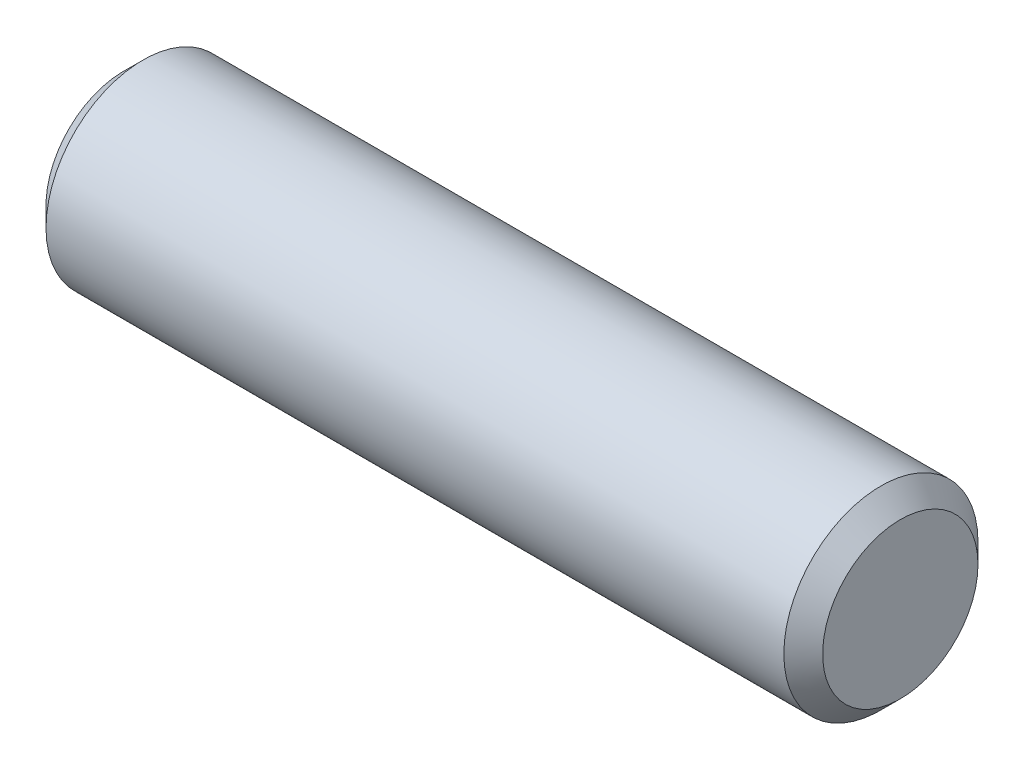
ISO-10303-21;
HEADER;
FILE_DESCRIPTION(('STEP AP214'),'2;1');
FILE_NAME('part.step','',(''),(''),'','','');
FILE_SCHEMA(('AUTOMOTIVE_DESIGN { 1 0 10303 214 1 1 1 1 }'));
ENDSEC;
DATA;
#1=APPLICATION_CONTEXT('core data for automotive mechanical design processes');
#2=APPLICATION_PROTOCOL_DEFINITION('international standard','automotive_design',2000,#1);
#3=PRODUCT_CONTEXT('',#1,'mechanical');
#4=PRODUCT('Part','Part','',(#3));
#5=PRODUCT_RELATED_PRODUCT_CATEGORY('part','',(#4));
#6=PRODUCT_DEFINITION_FORMATION('','',#4);
#7=PRODUCT_DEFINITION_CONTEXT('part definition',#1,'design');
#8=PRODUCT_DEFINITION('design','',#6,#7);
#9=PRODUCT_DEFINITION_SHAPE('','',#8);
#10=(LENGTH_UNIT() NAMED_UNIT(*) SI_UNIT(.MILLI.,.METRE.));
#11=(NAMED_UNIT(*) PLANE_ANGLE_UNIT() SI_UNIT($,.RADIAN.));
#12=(NAMED_UNIT(*) SI_UNIT($,.STERADIAN.) SOLID_ANGLE_UNIT());
#13=UNCERTAINTY_MEASURE_WITH_UNIT(LENGTH_MEASURE(1.E-05),#10,'distance_accuracy_value','');
#14=(GEOMETRIC_REPRESENTATION_CONTEXT(3) GLOBAL_UNCERTAINTY_ASSIGNED_CONTEXT((#13)) GLOBAL_UNIT_ASSIGNED_CONTEXT((#10,
#11,#12)) REPRESENTATION_CONTEXT('',''));
#15=CARTESIAN_POINT('',(0.,0.,0.));
#16=DIRECTION('',(0.,0.,1.));
#17=DIRECTION('',(1.,0.,0.));
#18=AXIS2_PLACEMENT_3D('',#15,#16,#17);
#19=CARTESIAN_POINT('',(-6.35,0.,0.));
#20=DIRECTION('',(1.,0.,0.));
#21=DIRECTION('',(0.,0.,-1.));
#22=AXIS2_PLACEMENT_3D('',#19,#20,#21);
#23=CYLINDRICAL_SURFACE('',#22,1.5875);
#24=CARTESIAN_POINT('',(6.0325,0.,0.));
#25=DIRECTION('',(1.,0.,0.));
#26=DIRECTION('',(0.,0.,-1.));
#27=AXIS2_PLACEMENT_3D('',#24,#25,#26);
#28=CIRCLE('',#27,1.5875);
#29=CARTESIAN_POINT('',(6.0325,0.,-1.5875));
#30=VERTEX_POINT('',#29);
#31=EDGE_CURVE('E39',#30,#30,#28,.F.);
#32=ORIENTED_EDGE('',*,*,#31,.T.);
#33=EDGE_LOOP('',(#32));
#34=FACE_BOUND('',#33,.T.);
#35=CARTESIAN_POINT('',(-6.0325,0.,0.));
#36=DIRECTION('',(1.,0.,0.));
#37=DIRECTION('',(0.,0.,-1.));
#38=AXIS2_PLACEMENT_3D('',#35,#36,#37);
#39=CIRCLE('',#38,1.5875);
#40=CARTESIAN_POINT('',(-6.0325,0.,-1.5875));
#41=VERTEX_POINT('',#40);
#42=EDGE_CURVE('E43',#41,#41,#39,.T.);
#43=ORIENTED_EDGE('',*,*,#42,.T.);
#44=EDGE_LOOP('',(#43));
#45=FACE_BOUND('',#44,.T.);
#46=ADVANCED_FACE('F32',(#34,#45),#23,.T.);
#47=CARTESIAN_POINT('',(-6.35,0.,0.));
#48=DIRECTION('',(1.,0.,0.));
#49=DIRECTION('',(0.,0.,-1.));
#50=AXIS2_PLACEMENT_3D('',#47,#48,#49);
#51=PLANE('',#50);
#52=CARTESIAN_POINT('',(-6.35,0.,0.));
#53=DIRECTION('',(1.,0.,0.));
#54=DIRECTION('',(0.,0.,-1.));
#55=AXIS2_PLACEMENT_3D('',#52,#53,#54);
#56=CIRCLE('',#55,1.27);
#57=CARTESIAN_POINT('',(-6.35,0.,-1.27));
#58=VERTEX_POINT('',#57);
#59=EDGE_CURVE('E10',#58,#58,#56,.F.);
#60=ORIENTED_EDGE('',*,*,#59,.T.);
#61=EDGE_LOOP('',(#60));
#62=FACE_BOUND('',#61,.T.);
#63=ADVANCED_FACE('F63',(#62),#51,.F.);
#64=CARTESIAN_POINT('',(6.35,0.,0.));
#65=DIRECTION('',(1.,0.,0.));
#66=DIRECTION('',(0.,0.,-1.));
#67=AXIS2_PLACEMENT_3D('',#64,#65,#66);
#68=PLANE('',#67);
#69=CARTESIAN_POINT('',(6.35,0.,0.));
#70=DIRECTION('',(1.,0.,0.));
#71=DIRECTION('',(0.,0.,-1.));
#72=AXIS2_PLACEMENT_3D('',#69,#70,#71);
#73=CIRCLE('',#72,1.27);
#74=CARTESIAN_POINT('',(6.35,0.,-1.27));
#75=VERTEX_POINT('',#74);
#76=EDGE_CURVE('E47',#75,#75,#73,.T.);
#77=ORIENTED_EDGE('',*,*,#76,.T.);
#78=EDGE_LOOP('',(#77));
#79=FACE_BOUND('',#78,.T.);
#80=ADVANCED_FACE('F53',(#79),#68,.T.);
#81=CARTESIAN_POINT('',(6.35,0.,0.));
#82=DIRECTION('',(-1.,0.,0.));
#83=DIRECTION('',(0.,0.,1.));
#84=AXIS2_PLACEMENT_3D('',#81,#82,#83);
#85=CONICAL_SURFACE('',#84,1.27,0.785398163397445);
#86=ORIENTED_EDGE('',*,*,#31,.F.);
#87=EDGE_LOOP('',(#86));
#88=FACE_BOUND('',#87,.T.);
#89=ORIENTED_EDGE('',*,*,#76,.F.);
#90=EDGE_LOOP('',(#89));
#91=FACE_BOUND('',#90,.T.);
#92=ADVANCED_FACE('F55',(#88,#91),#85,.T.);
#93=CARTESIAN_POINT('',(-6.0325,0.,0.));
#94=DIRECTION('',(1.,0.,0.));
#95=DIRECTION('',(0.,0.,-1.));
#96=AXIS2_PLACEMENT_3D('',#93,#94,#95);
#97=CONICAL_SURFACE('',#96,1.5875,0.785398163397448);
#98=ORIENTED_EDGE('',*,*,#59,.F.);
#99=EDGE_LOOP('',(#98));
#100=FACE_BOUND('',#99,.T.);
#101=ORIENTED_EDGE('',*,*,#42,.F.);
#102=EDGE_LOOP('',(#101));
#103=FACE_BOUND('',#102,.T.);
#104=ADVANCED_FACE('F34',(#100,#103),#97,.T.);
#105=CLOSED_SHELL('',(#46,#63,#80,#92,#104));
#106=MANIFOLD_SOLID_BREP('B2',#105);
#107=ADVANCED_BREP_SHAPE_REPRESENTATION('',(#18,#106),#14);
#108=SHAPE_DEFINITION_REPRESENTATION(#9,#107);
ENDSEC;
END-ISO-10303-21;
